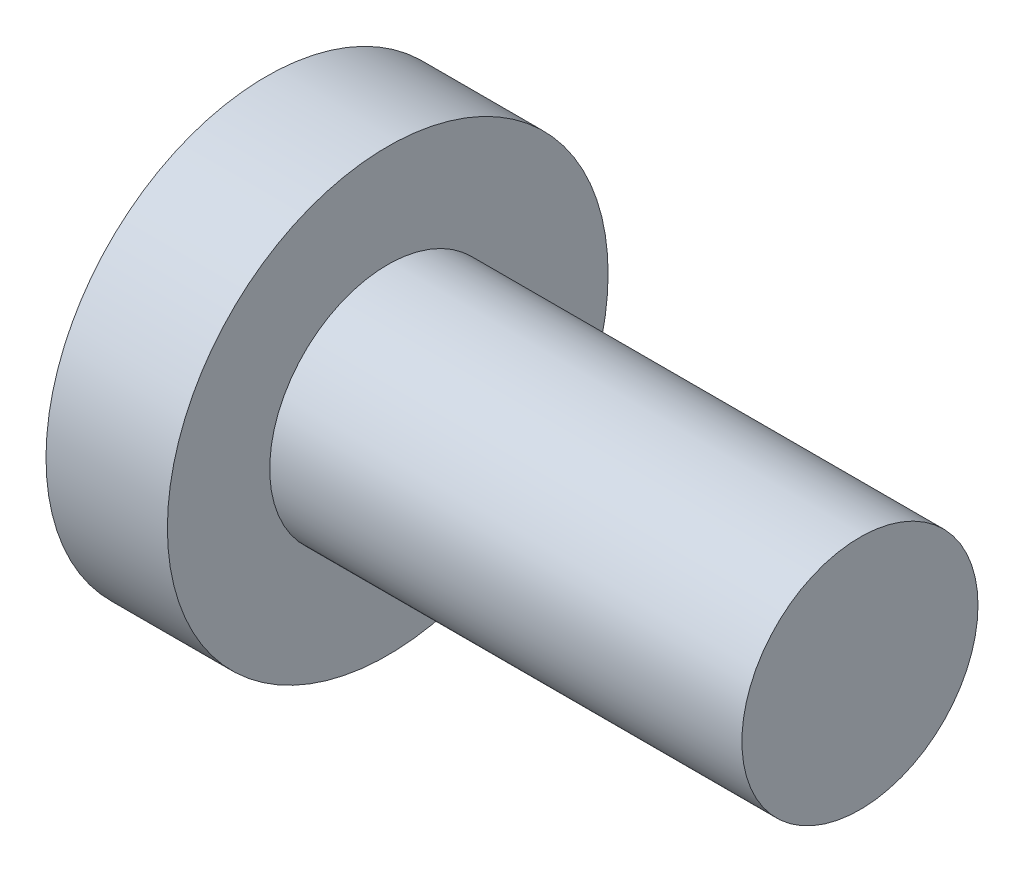
ISO-10303-21;
HEADER;
FILE_DESCRIPTION(('STEP AP214'),'2;1');
FILE_NAME('part.step','',(''),(''),'','','');
FILE_SCHEMA(('AUTOMOTIVE_DESIGN { 1 0 10303 214 1 1 1 1 }'));
ENDSEC;
DATA;
#1=APPLICATION_CONTEXT('core data for automotive mechanical design processes');
#2=APPLICATION_PROTOCOL_DEFINITION('international standard','automotive_design',2000,#1);
#3=PRODUCT_CONTEXT('',#1,'mechanical');
#4=PRODUCT('Part','Part','',(#3));
#5=PRODUCT_RELATED_PRODUCT_CATEGORY('part','',(#4));
#6=PRODUCT_DEFINITION_FORMATION('','',#4);
#7=PRODUCT_DEFINITION_CONTEXT('part definition',#1,'design');
#8=PRODUCT_DEFINITION('design','',#6,#7);
#9=PRODUCT_DEFINITION_SHAPE('','',#8);
#10=(LENGTH_UNIT() NAMED_UNIT(*) SI_UNIT(.MILLI.,.METRE.));
#11=(NAMED_UNIT(*) PLANE_ANGLE_UNIT() SI_UNIT($,.RADIAN.));
#12=(NAMED_UNIT(*) SI_UNIT($,.STERADIAN.) SOLID_ANGLE_UNIT());
#13=UNCERTAINTY_MEASURE_WITH_UNIT(LENGTH_MEASURE(1.E-05),#10,'distance_accuracy_value','');
#14=(GEOMETRIC_REPRESENTATION_CONTEXT(3) GLOBAL_UNCERTAINTY_ASSIGNED_CONTEXT((#13)) GLOBAL_UNIT_ASSIGNED_CONTEXT((#10,
#11,#12)) REPRESENTATION_CONTEXT('',''));
#15=CARTESIAN_POINT('',(0.,0.,0.));
#16=DIRECTION('',(0.,0.,1.));
#17=DIRECTION('',(1.,0.,0.));
#18=AXIS2_PLACEMENT_3D('',#15,#16,#17);
#19=CARTESIAN_POINT('',(5.,0.,0.));
#20=DIRECTION('',(1.,0.,0.));
#21=DIRECTION('',(0.,1.,0.));
#22=AXIS2_PLACEMENT_3D('',#19,#20,#21);
#23=SPHERICAL_SURFACE('',#22,5.);
#24=CARTESIAN_POINT('',(0.857536964558405,0.,0.));
#25=DIRECTION('',(1.,0.,0.));
#26=DIRECTION('',(0.,0.,-1.));
#27=AXIS2_PLACEMENT_3D('',#24,#25,#26);
#28=CIRCLE('',#27,2.8);
#29=CARTESIAN_POINT('',(0.857536964558405,0.,-2.8));
#30=VERTEX_POINT('',#29);
#31=EDGE_CURVE('E207',#30,#30,#28,.T.);
#32=ORIENTED_EDGE('',*,*,#31,.F.);
#33=EDGE_LOOP('',(#32));
#34=FACE_BOUND('',#33,.T.);
#35=CARTESIAN_POINT('',(5.,-0.3,0.));
#36=DIRECTION('',(0.,1.,0.));
#37=DIRECTION('',(0.,0.,1.));
#38=AXIS2_PLACEMENT_3D('',#35,#36,#37);
#39=CIRCLE('',#38,4.99099188538711);
#40=CARTESIAN_POINT('',(0.204192141108151,-0.3,1.3821096123648));
#41=VERTEX_POINT('',#40);
#42=CARTESIAN_POINT('',(0.0452043432650024,-0.3,0.6));
#43=VERTEX_POINT('',#42);
#44=EDGE_CURVE('E141',#41,#43,#39,.F.);
#45=ORIENTED_EDGE('',*,*,#44,.T.);
#46=CARTESIAN_POINT('',(0.0452043432650024,-0.3,0.6));
#47=CARTESIAN_POINT('',(0.0431803765733258,-0.299985307216759,0.58330066442328));
#48=CARTESIAN_POINT('',(0.0413275176268076,-0.301393621844251,0.566581310147069));
#49=CARTESIAN_POINT('',(0.0380100157488106,-0.306971694528783,0.533576799844294));
#50=CARTESIAN_POINT('',(0.0365452230698608,-0.311140385229224,0.517291478520808));
#51=CARTESIAN_POINT('',(0.0340472247062486,-0.322159146630374,0.48560301538607));
#52=CARTESIAN_POINT('',(0.0330143639783939,-0.329011352060552,0.470200587124305));
#53=CARTESIAN_POINT('',(0.0314127307694625,-0.345205676257373,0.440745323067069));
#54=CARTESIAN_POINT('',(0.0308438058607194,-0.354546975884403,0.426692045343612));
#55=CARTESIAN_POINT('',(0.0301895329231602,-0.375375503630217,0.400444519821415));
#56=CARTESIAN_POINT('',(0.0301004392402796,-0.386845384782284,0.38823659768892));
#57=CARTESIAN_POINT('',(0.0303984595749412,-0.411653153039893,0.365897305977699));
#58=CARTESIAN_POINT('',(0.0307856444365278,-0.424991317781719,0.355766245583268));
#59=CARTESIAN_POINT('',(0.0320223810339674,-0.453099677373167,0.337899284835797));
#60=CARTESIAN_POINT('',(0.0328703456862305,-0.467864814543113,0.33015530522925));
#61=CARTESIAN_POINT('',(0.0350026994062981,-0.498444042646254,0.317225069756469));
#62=CARTESIAN_POINT('',(0.0362869304045912,-0.514257751989369,0.312037889168157));
#63=CARTESIAN_POINT('',(0.0388210734003055,-0.541786224745503,0.305467740201196));
#64=CARTESIAN_POINT('',(0.0399723661586706,-0.553355690495333,0.303417160437875));
#65=CARTESIAN_POINT('',(0.0424563450668784,-0.576618891467464,0.300683149774227));
#66=CARTESIAN_POINT('',(0.0437887689490347,-0.588312424882147,0.299997764205199));
#67=CARTESIAN_POINT('',(0.0452043432650015,-0.6,0.3));
#68=B_SPLINE_CURVE_WITH_KNOTS('',3,(#46,#47,#48,#49,#50,#51,#52,#53,#54,#55,#56,#57,#58,#59,#60,
#61,#62,#63,#64,#65,#66,#67),.UNSPECIFIED.,.F.,.F.,(4,2,2,2,2,2,2,2,2,2,4),(0.,
0.0504040124836527,0.100788546583664,0.151213243139993,0.201621365810884,0.251635416538133,
0.3016569075042,0.351507189411116,0.401339428623963,0.43668054551031,0.47197102493103),.UNSPECIFIED.);
#69=CARTESIAN_POINT('',(0.0452043432650024,-0.6,0.3));
#70=VERTEX_POINT('',#69);
#71=EDGE_CURVE('E126',#43,#70,#68,.T.);
#72=ORIENTED_EDGE('',*,*,#71,.T.);
#73=CARTESIAN_POINT('',(5.,0.,0.3));
#74=DIRECTION('',(0.,0.,-1.));
#75=DIRECTION('',(0.,1.,0.));
#76=AXIS2_PLACEMENT_3D('',#73,#74,#75);
#77=CIRCLE('',#76,4.99099188538711);
#78=CARTESIAN_POINT('',(0.204192141108151,-1.3821096123648,0.3));
#79=VERTEX_POINT('',#78);
#80=EDGE_CURVE('E150',#70,#79,#77,.F.);
#81=ORIENTED_EDGE('',*,*,#80,.T.);
#82=CARTESIAN_POINT('',(4.39951905283833,1.0400635094611,0.));
#83=DIRECTION('',(-0.5,0.866025403784438,0.));
#84=DIRECTION('',(-0.866025403784438,-0.5,0.));
#85=AXIS2_PLACEMENT_3D('',#82,#83,#84);
#86=CIRCLE('',#85,4.8536265336739);
#87=CARTESIAN_POINT('',(0.204192141108151,-1.3821096123648,-0.3));
#88=VERTEX_POINT('',#87);
#89=EDGE_CURVE('E153',#79,#88,#86,.F.);
#90=ORIENTED_EDGE('',*,*,#89,.T.);
#91=CARTESIAN_POINT('',(5.,0.,-0.3));
#92=DIRECTION('',(0.,0.,1.));
#93=DIRECTION('',(1.,0.,0.));
#94=AXIS2_PLACEMENT_3D('',#91,#92,#93);
#95=CIRCLE('',#94,4.99099188538711);
#96=CARTESIAN_POINT('',(0.0452043432650024,-0.6,-0.3));
#97=VERTEX_POINT('',#96);
#98=EDGE_CURVE('E160',#88,#97,#95,.F.);
#99=ORIENTED_EDGE('',*,*,#98,.T.);
#100=CARTESIAN_POINT('',(0.0452043432650024,-0.6,-0.3));
#101=CARTESIAN_POINT('',(0.0431803765733257,-0.58330066442328,-0.299985307216759));
#102=CARTESIAN_POINT('',(0.0413275176268075,-0.56658131014707,-0.30139362184425));
#103=CARTESIAN_POINT('',(0.0380100157488106,-0.533576799844295,-0.306971694528783));
#104=CARTESIAN_POINT('',(0.0365452230698608,-0.517291478520809,-0.311140385229224));
#105=CARTESIAN_POINT('',(0.0340472247062486,-0.485603015386071,-0.322159146630374));
#106=CARTESIAN_POINT('',(0.0330143639783939,-0.470200587124306,-0.329011352060552));
#107=CARTESIAN_POINT('',(0.0314127307694625,-0.440745323067069,-0.345205676257373));
#108=CARTESIAN_POINT('',(0.0308438058607194,-0.426692045343612,-0.354546975884403));
#109=CARTESIAN_POINT('',(0.0301895329231602,-0.400444519821415,-0.375375503630217));
#110=CARTESIAN_POINT('',(0.0301004392402796,-0.38823659768892,-0.386845384782284));
#111=CARTESIAN_POINT('',(0.0303984595749412,-0.365897305977699,-0.411653153039893));
#112=CARTESIAN_POINT('',(0.0307856444365278,-0.355766245583269,-0.424991317781719));
#113=CARTESIAN_POINT('',(0.0320223810339674,-0.337899284835798,-0.453099677373167));
#114=CARTESIAN_POINT('',(0.0328703456862304,-0.330155305229251,-0.467864814543114));
#115=CARTESIAN_POINT('',(0.035002699406298,-0.317225069756469,-0.498444042646254));
#116=CARTESIAN_POINT('',(0.0362869304045912,-0.312037889168157,-0.514257751989369));
#117=CARTESIAN_POINT('',(0.0388210734003055,-0.305467740201196,-0.541786224745503));
#118=CARTESIAN_POINT('',(0.0399723661586706,-0.303417160437875,-0.553355690495333));
#119=CARTESIAN_POINT('',(0.0424563450668784,-0.300683149774227,-0.576618891467464));
#120=CARTESIAN_POINT('',(0.0437887689490347,-0.299997764205199,-0.588312424882147));
#121=CARTESIAN_POINT('',(0.0452043432650014,-0.3,-0.6));
#122=B_SPLINE_CURVE_WITH_KNOTS('',3,(#100,#101,#102,#103,#104,#105,#106,#107,#108,#109,#110,
#111,#112,#113,#114,#115,#116,#117,#118,#119,#120,#121),.UNSPECIFIED.,.F.,.F.,(4,2,2,2,2,2,2,2,
2,2,4),(0.,0.0504040124836521,0.100788546583663,0.151213243139993,0.201621365810884,
0.251635416538133,0.3016569075042,0.351507189411116,0.401339428623963,0.436680545510309,
0.471971024931029),.UNSPECIFIED.);
#123=CARTESIAN_POINT('',(0.0452043432650024,-0.3,-0.6));
#124=VERTEX_POINT('',#123);
#125=EDGE_CURVE('E137',#97,#124,#122,.T.);
#126=ORIENTED_EDGE('',*,*,#125,.T.);
#127=CARTESIAN_POINT('',(5.,-0.3,0.));
#128=DIRECTION('',(0.,1.,0.));
#129=DIRECTION('',(0.,0.,1.));
#130=AXIS2_PLACEMENT_3D('',#127,#128,#129);
#131=CIRCLE('',#130,4.99099188538711);
#132=CARTESIAN_POINT('',(0.204192141108152,-0.3,-1.3821096123648));
#133=VERTEX_POINT('',#132);
#134=EDGE_CURVE('E158',#124,#133,#131,.F.);
#135=ORIENTED_EDGE('',*,*,#134,.T.);
#136=CARTESIAN_POINT('',(4.39951905283833,0.,1.0400635094611));
#137=DIRECTION('',(-0.5,0.,0.866025403784438));
#138=DIRECTION('',(0.866025403784438,0.,0.5));
#139=AXIS2_PLACEMENT_3D('',#136,#137,#138);
#140=CIRCLE('',#139,4.8536265336739);
#141=CARTESIAN_POINT('',(0.204192141108152,0.3,-1.3821096123648));
#142=VERTEX_POINT('',#141);
#143=EDGE_CURVE('E161',#133,#142,#140,.F.);
#144=ORIENTED_EDGE('',*,*,#143,.T.);
#145=CARTESIAN_POINT('',(5.,0.3,0.));
#146=DIRECTION('',(0.,-1.,0.));
#147=DIRECTION('',(0.,0.,-1.));
#148=AXIS2_PLACEMENT_3D('',#145,#146,#147);
#149=CIRCLE('',#148,4.99099188538711);
#150=CARTESIAN_POINT('',(0.0452043432650024,0.3,-0.6));
#151=VERTEX_POINT('',#150);
#152=EDGE_CURVE('E162',#142,#151,#149,.F.);
#153=ORIENTED_EDGE('',*,*,#152,.T.);
#154=CARTESIAN_POINT('',(0.0452043432650024,0.3,-0.6));
#155=CARTESIAN_POINT('',(0.0431803765733258,0.299985307216759,-0.58330066442328));
#156=CARTESIAN_POINT('',(0.0413275176268076,0.301393621844251,-0.56658131014707));
#157=CARTESIAN_POINT('',(0.0380100157488106,0.306971694528782,-0.533576799844295));
#158=CARTESIAN_POINT('',(0.0365452230698608,0.311140385229223,-0.517291478520809));
#159=CARTESIAN_POINT('',(0.0340472247062486,0.322159146630374,-0.485603015386071));
#160=CARTESIAN_POINT('',(0.033014363978394,0.329011352060551,-0.470200587124306));
#161=CARTESIAN_POINT('',(0.0314127307694625,0.345205676257373,-0.44074532306707));
#162=CARTESIAN_POINT('',(0.0308438058607194,0.354546975884402,-0.426692045343612));
#163=CARTESIAN_POINT('',(0.0301895329231602,0.375375503630217,-0.400444519821416));
#164=CARTESIAN_POINT('',(0.0301004392402796,0.386845384782283,-0.388236597688921));
#165=CARTESIAN_POINT('',(0.0303984595749411,0.411653153039892,-0.3658973059777));
#166=CARTESIAN_POINT('',(0.0307856444365276,0.424991317781719,-0.355766245583269));
#167=CARTESIAN_POINT('',(0.0320223810339676,0.453099677373167,-0.337899284835798));
#168=CARTESIAN_POINT('',(0.0328703456862313,0.467864814543113,-0.330155305229251));
#169=CARTESIAN_POINT('',(0.0350026994062988,0.498444042646254,-0.317225069756469));
#170=CARTESIAN_POINT('',(0.0362869304045914,0.514257751989368,-0.312037889168158));
#171=CARTESIAN_POINT('',(0.0388210734003053,0.541786224745503,-0.305467740201196));
#172=CARTESIAN_POINT('',(0.0399723661586704,0.553355690495333,-0.303417160437876));
#173=CARTESIAN_POINT('',(0.0424563450668784,0.576618891467464,-0.300683149774227));
#174=CARTESIAN_POINT('',(0.0437887689490348,0.588312424882147,-0.299997764205199));
#175=CARTESIAN_POINT('',(0.0452043432650014,0.6,-0.3));
#176=B_SPLINE_CURVE_WITH_KNOTS('',3,(#154,#155,#156,#157,#158,#159,#160,#161,#162,#163,#164,
#165,#166,#167,#168,#169,#170,#171,#172,#173,#174,#175),.UNSPECIFIED.,.F.,.F.,(4,2,2,2,2,2,2,2,
2,2,4),(0.,0.0504040124836521,0.100788546583663,0.151213243139993,0.201621365810883,
0.251635416538133,0.3016569075042,0.351507189411115,0.401339428623963,0.436680545510309,
0.471971024931029),.UNSPECIFIED.);
#177=CARTESIAN_POINT('',(0.0452043432650024,0.6,-0.3));
#178=VERTEX_POINT('',#177);
#179=EDGE_CURVE('E144',#151,#178,#176,.T.);
#180=ORIENTED_EDGE('',*,*,#179,.T.);
#181=CARTESIAN_POINT('',(5.,0.,-0.3));
#182=DIRECTION('',(0.,0.,1.));
#183=DIRECTION('',(1.,0.,0.));
#184=AXIS2_PLACEMENT_3D('',#181,#182,#183);
#185=CIRCLE('',#184,4.99099188538711);
#186=CARTESIAN_POINT('',(0.204192141108151,1.3821096123648,-0.3));
#187=VERTEX_POINT('',#186);
#188=EDGE_CURVE('E165',#178,#187,#185,.F.);
#189=ORIENTED_EDGE('',*,*,#188,.T.);
#190=CARTESIAN_POINT('',(4.39951905283833,-1.0400635094611,0.));
#191=DIRECTION('',(-0.5,-0.866025403784438,0.));
#192=DIRECTION('',(0.866025403784438,-0.5,0.));
#193=AXIS2_PLACEMENT_3D('',#190,#191,#192);
#194=CIRCLE('',#193,4.8536265336739);
#195=CARTESIAN_POINT('',(0.204192141108151,1.3821096123648,0.3));
#196=VERTEX_POINT('',#195);
#197=EDGE_CURVE('E191',#187,#196,#194,.F.);
#198=ORIENTED_EDGE('',*,*,#197,.T.);
#199=CARTESIAN_POINT('',(5.,0.,0.3));
#200=DIRECTION('',(0.,0.,-1.));
#201=DIRECTION('',(0.,1.,0.));
#202=AXIS2_PLACEMENT_3D('',#199,#200,#201);
#203=CIRCLE('',#202,4.99099188538711);
#204=CARTESIAN_POINT('',(0.0452043432650024,0.6,0.3));
#205=VERTEX_POINT('',#204);
#206=EDGE_CURVE('E194',#196,#205,#203,.F.);
#207=ORIENTED_EDGE('',*,*,#206,.T.);
#208=CARTESIAN_POINT('',(0.0452043432650024,0.6,0.3));
#209=CARTESIAN_POINT('',(0.0431803765733258,0.58330066442328,0.299985307216759));
#210=CARTESIAN_POINT('',(0.0413275176268076,0.56658131014707,0.301393621844251));
#211=CARTESIAN_POINT('',(0.0380100157488106,0.533576799844295,0.306971694528782));
#212=CARTESIAN_POINT('',(0.0365452230698608,0.517291478520809,0.311140385229223));
#213=CARTESIAN_POINT('',(0.0340472247062486,0.485603015386071,0.322159146630374));
#214=CARTESIAN_POINT('',(0.033014363978394,0.470200587124306,0.329011352060551));
#215=CARTESIAN_POINT('',(0.0314127307694625,0.44074532306707,0.345205676257373));
#216=CARTESIAN_POINT('',(0.0308438058607194,0.426692045343612,0.354546975884402));
#217=CARTESIAN_POINT('',(0.0301895329231602,0.400444519821415,0.375375503630217));
#218=CARTESIAN_POINT('',(0.0301004392402796,0.38823659768892,0.386845384782283));
#219=CARTESIAN_POINT('',(0.0303984595749412,0.3658973059777,0.411653153039893));
#220=CARTESIAN_POINT('',(0.0307856444365278,0.355766245583269,0.424991317781719));
#221=CARTESIAN_POINT('',(0.0320223810339674,0.337899284835798,0.453099677373167));
#222=CARTESIAN_POINT('',(0.0328703456862304,0.330155305229251,0.467864814543113));
#223=CARTESIAN_POINT('',(0.035002699406298,0.317225069756469,0.498444042646254));
#224=CARTESIAN_POINT('',(0.0362869304045912,0.312037889168157,0.514257751989369));
#225=CARTESIAN_POINT('',(0.0388210734003055,0.305467740201196,0.541786224745503));
#226=CARTESIAN_POINT('',(0.0399723661586705,0.303417160437875,0.553355690495333));
#227=CARTESIAN_POINT('',(0.0424563450668783,0.300683149774227,0.576618891467464));
#228=CARTESIAN_POINT('',(0.0437887689490347,0.299997764205199,0.588312424882147));
#229=CARTESIAN_POINT('',(0.0452043432650014,0.3,0.6));
#230=B_SPLINE_CURVE_WITH_KNOTS('',3,(#208,#209,#210,#211,#212,#213,#214,#215,#216,#217,#218,
#219,#220,#221,#222,#223,#224,#225,#226,#227,#228,#229),.UNSPECIFIED.,.F.,.F.,(4,2,2,2,2,2,2,2,
2,2,4),(0.,0.0504040124836521,0.100788546583663,0.151213243139993,0.201621365810884,
0.251635416538133,0.3016569075042,0.351507189411116,0.401339428623963,0.43668054551031,
0.47197102493103),.UNSPECIFIED.);
#231=CARTESIAN_POINT('',(0.0452043432650024,0.3,0.6));
#232=VERTEX_POINT('',#231);
#233=EDGE_CURVE('E264',#205,#232,#230,.T.);
#234=ORIENTED_EDGE('',*,*,#233,.T.);
#235=CARTESIAN_POINT('',(5.,0.3,0.));
#236=DIRECTION('',(0.,-1.,0.));
#237=DIRECTION('',(0.,0.,-1.));
#238=AXIS2_PLACEMENT_3D('',#235,#236,#237);
#239=CIRCLE('',#238,4.99099188538711);
#240=CARTESIAN_POINT('',(0.204192141108151,0.3,1.3821096123648));
#241=VERTEX_POINT('',#240);
#242=EDGE_CURVE('E145',#232,#241,#239,.F.);
#243=ORIENTED_EDGE('',*,*,#242,.T.);
#244=CARTESIAN_POINT('',(4.39951905283833,0.,-1.0400635094611));
#245=DIRECTION('',(-0.5,0.,-0.866025403784438));
#246=DIRECTION('',(-0.866025403784438,0.,0.5));
#247=AXIS2_PLACEMENT_3D('',#244,#245,#246);
#248=CIRCLE('',#247,4.8536265336739);
#249=EDGE_CURVE('E149',#241,#41,#248,.F.);
#250=ORIENTED_EDGE('',*,*,#249,.T.);
#251=EDGE_LOOP('',(#45,#72,#81,#90,#99,#126,#135,#144,#153,#180,#189,#198,#207,#234,#243,#250));
#252=FACE_BOUND('',#251,.T.);
#253=ADVANCED_FACE('F16',(#34,#252),#23,.T.);
#254=CARTESIAN_POINT('',(8.4,1.5,0.));
#255=DIRECTION('',(1.,0.,0.));
#256=DIRECTION('',(0.,0.,-1.));
#257=AXIS2_PLACEMENT_3D('',#254,#255,#256);
#258=PLANE('',#257);
#259=CARTESIAN_POINT('',(8.4,0.,0.));
#260=DIRECTION('',(1.,0.,0.));
#261=DIRECTION('',(0.,0.,-1.));
#262=AXIS2_PLACEMENT_3D('',#259,#260,#261);
#263=CIRCLE('',#262,1.5);
#264=CARTESIAN_POINT('',(8.4,0.,-1.5));
#265=VERTEX_POINT('',#264);
#266=EDGE_CURVE('E246',#265,#265,#263,.T.);
#267=ORIENTED_EDGE('',*,*,#266,.T.);
#268=EDGE_LOOP('',(#267));
#269=FACE_BOUND('',#268,.T.);
#270=ADVANCED_FACE('F304',(#269),#258,.T.);
#271=CARTESIAN_POINT('',(4.51581291088132,0.,0.));
#272=DIRECTION('',(1.,0.,0.));
#273=DIRECTION('',(0.,0.,-1.));
#274=AXIS2_PLACEMENT_3D('',#271,#272,#273);
#275=CYLINDRICAL_SURFACE('',#274,1.5);
#276=CARTESIAN_POINT('',(2.4,0.,0.));
#277=DIRECTION('',(1.,0.,0.));
#278=DIRECTION('',(0.,0.,-1.));
#279=AXIS2_PLACEMENT_3D('',#276,#277,#278);
#280=CIRCLE('',#279,1.5);
#281=CARTESIAN_POINT('',(2.4,0.,-1.5));
#282=VERTEX_POINT('',#281);
#283=EDGE_CURVE('E248',#282,#282,#280,.T.);
#284=ORIENTED_EDGE('',*,*,#283,.T.);
#285=EDGE_LOOP('',(#284));
#286=FACE_BOUND('',#285,.T.);
#287=ORIENTED_EDGE('',*,*,#266,.F.);
#288=EDGE_LOOP('',(#287));
#289=FACE_BOUND('',#288,.T.);
#290=ADVANCED_FACE('F310',(#286,#289),#275,.T.);
#291=CARTESIAN_POINT('',(2.4,1.8,0.));
#292=DIRECTION('',(1.,0.,0.));
#293=DIRECTION('',(0.,0.,-1.));
#294=AXIS2_PLACEMENT_3D('',#291,#292,#293);
#295=PLANE('',#294);
#296=CARTESIAN_POINT('',(2.4,0.,0.));
#297=DIRECTION('',(1.,0.,0.));
#298=DIRECTION('',(0.,0.,-1.));
#299=AXIS2_PLACEMENT_3D('',#296,#297,#298);
#300=CIRCLE('',#299,2.8);
#301=CARTESIAN_POINT('',(2.4,0.,-2.8));
#302=VERTEX_POINT('',#301);
#303=EDGE_CURVE('E253',#302,#302,#300,.T.);
#304=ORIENTED_EDGE('',*,*,#303,.T.);
#305=EDGE_LOOP('',(#304));
#306=FACE_BOUND('',#305,.T.);
#307=ORIENTED_EDGE('',*,*,#283,.F.);
#308=EDGE_LOOP('',(#307));
#309=FACE_BOUND('',#308,.T.);
#310=ADVANCED_FACE('F319',(#306,#309),#295,.T.);
#311=CARTESIAN_POINT('',(4.51581291088132,0.,0.));
#312=DIRECTION('',(1.,0.,0.));
#313=DIRECTION('',(0.,0.,-1.));
#314=AXIS2_PLACEMENT_3D('',#311,#312,#313);
#315=CYLINDRICAL_SURFACE('',#314,2.8);
#316=ORIENTED_EDGE('',*,*,#31,.T.);
#317=EDGE_LOOP('',(#316));
#318=FACE_BOUND('',#317,.T.);
#319=ORIENTED_EDGE('',*,*,#303,.F.);
#320=EDGE_LOOP('',(#319));
#321=FACE_BOUND('',#320,.T.);
#322=ADVANCED_FACE('F300',(#318,#321),#315,.T.);
#323=CARTESIAN_POINT('',(1.68,0.3,0.3));
#324=DIRECTION('',(0.,-1.,0.));
#325=DIRECTION('',(0.,0.,-1.));
#326=AXIS2_PLACEMENT_3D('',#323,#324,#325);
#327=PLANE('',#326);
#328=ORIENTED_EDGE('',*,*,#242,.F.);
#329=DIRECTION('',(-1.,0.,0.));
#330=VECTOR('',#329,1.);
#331=CARTESIAN_POINT('',(1.68,0.3,0.6));
#332=LINE('',#331,#330);
#333=CARTESIAN_POINT('',(1.55884572681199,0.3,0.6));
#334=VERTEX_POINT('',#333);
#335=EDGE_CURVE('E355',#232,#334,#332,.F.);
#336=ORIENTED_EDGE('',*,*,#335,.T.);
#337=DIRECTION('',(-0.866025403784438,0.,0.5));
#338=VECTOR('',#337,1.);
#339=CARTESIAN_POINT('',(0.,0.3,1.5));
#340=LINE('',#339,#338);
#341=EDGE_CURVE('E205',#334,#241,#340,.T.);
#342=ORIENTED_EDGE('',*,*,#341,.T.);
#343=EDGE_LOOP('',(#328,#336,#342));
#344=FACE_BOUND('',#343,.T.);
#345=ADVANCED_FACE('F291',(#344),#327,.T.);
#346=CARTESIAN_POINT('',(0.,0.,1.5));
#347=DIRECTION('',(-0.5,0.,-0.866025403784438));
#348=DIRECTION('',(-0.866025403784438,0.,0.5));
#349=AXIS2_PLACEMENT_3D('',#346,#347,#348);
#350=PLANE('',#349);
#351=ORIENTED_EDGE('',*,*,#341,.F.);
#352=CARTESIAN_POINT('',(1.55884572681199,0.6,0.6));
#353=DIRECTION('',(-0.5,0.,-0.866025403784438));
#354=DIRECTION('',(-0.866025403784438,0.,0.5));
#355=AXIS2_PLACEMENT_3D('',#352,#353,#354);
#356=ELLIPSE('',#355,0.6,0.3);
#357=CARTESIAN_POINT('',(1.68,0.308268592658542,0.530051547761426));
#358=VERTEX_POINT('',#357);
#359=EDGE_CURVE('E212',#334,#358,#356,.F.);
#360=ORIENTED_EDGE('',*,*,#359,.T.);
#361=DIRECTION('',(0.,-1.,0.));
#362=VECTOR('',#361,1.);
#363=CARTESIAN_POINT('',(1.68,0.,0.530051547761426));
#364=LINE('',#363,#362);
#365=CARTESIAN_POINT('',(1.68,-0.308268592658542,0.530051547761426));
#366=VERTEX_POINT('',#365);
#367=EDGE_CURVE('E178',#358,#366,#364,.T.);
#368=ORIENTED_EDGE('',*,*,#367,.T.);
#369=CARTESIAN_POINT('',(1.55884572681199,-0.6,0.6));
#370=DIRECTION('',(-0.5,0.,-0.866025403784438));
#371=DIRECTION('',(-0.866025403784438,0.,0.5));
#372=AXIS2_PLACEMENT_3D('',#369,#370,#371);
#373=ELLIPSE('',#372,0.6,0.3);
#374=CARTESIAN_POINT('',(1.55884572681199,-0.3,0.6));
#375=VERTEX_POINT('',#374);
#376=EDGE_CURVE('E204',#375,#366,#373,.T.);
#377=ORIENTED_EDGE('',*,*,#376,.F.);
#378=DIRECTION('',(-0.866025403784438,0.,0.5));
#379=VECTOR('',#378,1.);
#380=CARTESIAN_POINT('',(1.77961524227066,-0.3,0.472538660821069));
#381=LINE('',#380,#379);
#382=EDGE_CURVE('E143',#375,#41,#381,.T.);
#383=ORIENTED_EDGE('',*,*,#382,.T.);
#384=ORIENTED_EDGE('',*,*,#249,.F.);
#385=EDGE_LOOP('',(#351,#360,#368,#377,#383,#384));
#386=FACE_BOUND('',#385,.T.);
#387=ADVANCED_FACE('F289',(#386),#350,.T.);
#388=CARTESIAN_POINT('',(1.68,-0.3,0.3));
#389=DIRECTION('',(0.,1.,0.));
#390=DIRECTION('',(0.,0.,1.));
#391=AXIS2_PLACEMENT_3D('',#388,#389,#390);
#392=PLANE('',#391);
#393=ORIENTED_EDGE('',*,*,#382,.F.);
#394=DIRECTION('',(-1.,0.,0.));
#395=VECTOR('',#394,1.);
#396=CARTESIAN_POINT('',(1.68,-0.3,0.6));
#397=LINE('',#396,#395);
#398=EDGE_CURVE('E130',#375,#43,#397,.T.);
#399=ORIENTED_EDGE('',*,*,#398,.T.);
#400=ORIENTED_EDGE('',*,*,#44,.F.);
#401=EDGE_LOOP('',(#393,#399,#400));
#402=FACE_BOUND('',#401,.T.);
#403=ADVANCED_FACE('F140',(#402),#392,.T.);
#404=CARTESIAN_POINT('',(1.68,-0.3,0.3));
#405=DIRECTION('',(0.,0.,-1.));
#406=DIRECTION('',(0.,1.,0.));
#407=AXIS2_PLACEMENT_3D('',#404,#405,#406);
#408=PLANE('',#407);
#409=ORIENTED_EDGE('',*,*,#80,.F.);
#410=DIRECTION('',(-1.,0.,0.));
#411=VECTOR('',#410,1.);
#412=CARTESIAN_POINT('',(1.68,-0.6,0.3));
#413=LINE('',#412,#411);
#414=CARTESIAN_POINT('',(1.55884572681199,-0.6,0.3));
#415=VERTEX_POINT('',#414);
#416=EDGE_CURVE('E133',#70,#415,#413,.F.);
#417=ORIENTED_EDGE('',*,*,#416,.T.);
#418=DIRECTION('',(-0.866025403784438,-0.5,0.));
#419=VECTOR('',#418,1.);
#420=CARTESIAN_POINT('',(0.,-1.5,0.3));
#421=LINE('',#420,#419);
#422=EDGE_CURVE('E166',#415,#79,#421,.T.);
#423=ORIENTED_EDGE('',*,*,#422,.T.);
#424=EDGE_LOOP('',(#409,#417,#423));
#425=FACE_BOUND('',#424,.T.);
#426=ADVANCED_FACE('F284',(#425),#408,.T.);
#427=CARTESIAN_POINT('',(0.,-1.5,0.));
#428=DIRECTION('',(-0.5,0.866025403784438,0.));
#429=DIRECTION('',(-0.866025403784438,-0.5,0.));
#430=AXIS2_PLACEMENT_3D('',#427,#428,#429);
#431=PLANE('',#430);
#432=ORIENTED_EDGE('',*,*,#422,.F.);
#433=CARTESIAN_POINT('',(1.55884572681199,-0.6,0.6));
#434=DIRECTION('',(-0.5,0.866025403784438,0.));
#435=DIRECTION('',(-0.866025403784438,-0.5,0.));
#436=AXIS2_PLACEMENT_3D('',#433,#434,#435);
#437=ELLIPSE('',#436,0.6,0.3);
#438=CARTESIAN_POINT('',(1.68,-0.530051547761426,0.308268592658541));
#439=VERTEX_POINT('',#438);
#440=EDGE_CURVE('E181',#415,#439,#437,.F.);
#441=ORIENTED_EDGE('',*,*,#440,.T.);
#442=DIRECTION('',(0.,0.,-1.));
#443=VECTOR('',#442,1.);
#444=CARTESIAN_POINT('',(1.68,-0.530051547761426,0.));
#445=LINE('',#444,#443);
#446=CARTESIAN_POINT('',(1.68,-0.530051547761426,-0.308268592658542));
#447=VERTEX_POINT('',#446);
#448=EDGE_CURVE('E175',#439,#447,#445,.T.);
#449=ORIENTED_EDGE('',*,*,#448,.T.);
#450=CARTESIAN_POINT('',(1.55884572681199,-0.6,-0.6));
#451=DIRECTION('',(-0.5,0.866025403784438,0.));
#452=DIRECTION('',(-0.866025403784438,-0.5,0.));
#453=AXIS2_PLACEMENT_3D('',#450,#451,#452);
#454=ELLIPSE('',#453,0.6,0.3);
#455=CARTESIAN_POINT('',(1.55884572681199,-0.6,-0.3));
#456=VERTEX_POINT('',#455);
#457=EDGE_CURVE('E179',#456,#447,#454,.T.);
#458=ORIENTED_EDGE('',*,*,#457,.F.);
#459=DIRECTION('',(-0.866025403784438,-0.5,0.));
#460=VECTOR('',#459,1.);
#461=CARTESIAN_POINT('',(1.77961524227066,-0.472538660821069,-0.3));
#462=LINE('',#461,#460);
#463=EDGE_CURVE('E169',#456,#88,#462,.T.);
#464=ORIENTED_EDGE('',*,*,#463,.T.);
#465=ORIENTED_EDGE('',*,*,#89,.F.);
#466=EDGE_LOOP('',(#432,#441,#449,#458,#464,#465));
#467=FACE_BOUND('',#466,.T.);
#468=ADVANCED_FACE('F280',(#467),#431,.T.);
#469=CARTESIAN_POINT('',(1.68,-0.3,-0.3));
#470=DIRECTION('',(0.,0.,1.));
#471=DIRECTION('',(1.,0.,0.));
#472=AXIS2_PLACEMENT_3D('',#469,#470,#471);
#473=PLANE('',#472);
#474=ORIENTED_EDGE('',*,*,#463,.F.);
#475=DIRECTION('',(-1.,0.,0.));
#476=VECTOR('',#475,1.);
#477=CARTESIAN_POINT('',(1.68,-0.6,-0.3));
#478=LINE('',#477,#476);
#479=EDGE_CURVE('E346',#456,#97,#478,.T.);
#480=ORIENTED_EDGE('',*,*,#479,.T.);
#481=ORIENTED_EDGE('',*,*,#98,.F.);
#482=EDGE_LOOP('',(#474,#480,#481));
#483=FACE_BOUND('',#482,.T.);
#484=ADVANCED_FACE('F283',(#483),#473,.T.);
#485=CARTESIAN_POINT('',(1.68,-0.3,-0.3));
#486=DIRECTION('',(0.,1.,0.));
#487=DIRECTION('',(0.,0.,1.));
#488=AXIS2_PLACEMENT_3D('',#485,#486,#487);
#489=PLANE('',#488);
#490=ORIENTED_EDGE('',*,*,#134,.F.);
#491=DIRECTION('',(-1.,0.,0.));
#492=VECTOR('',#491,1.);
#493=CARTESIAN_POINT('',(1.68,-0.3,-0.6));
#494=LINE('',#493,#492);
#495=CARTESIAN_POINT('',(1.55884572681199,-0.3,-0.6));
#496=VERTEX_POINT('',#495);
#497=EDGE_CURVE('E349',#124,#496,#494,.F.);
#498=ORIENTED_EDGE('',*,*,#497,.T.);
#499=DIRECTION('',(-0.866025403784438,0.,-0.5));
#500=VECTOR('',#499,1.);
#501=CARTESIAN_POINT('',(0.,-0.3,-1.5));
#502=LINE('',#501,#500);
#503=EDGE_CURVE('E174',#496,#133,#502,.T.);
#504=ORIENTED_EDGE('',*,*,#503,.T.);
#505=EDGE_LOOP('',(#490,#498,#504));
#506=FACE_BOUND('',#505,.T.);
#507=ADVANCED_FACE('F288',(#506),#489,.T.);
#508=CARTESIAN_POINT('',(0.,0.,-1.5));
#509=DIRECTION('',(-0.5,0.,0.866025403784438));
#510=DIRECTION('',(0.866025403784438,0.,0.5));
#511=AXIS2_PLACEMENT_3D('',#508,#509,#510);
#512=PLANE('',#511);
#513=ORIENTED_EDGE('',*,*,#503,.F.);
#514=CARTESIAN_POINT('',(1.55884572681199,-0.6,-0.6));
#515=DIRECTION('',(-0.5,0.,0.866025403784438));
#516=DIRECTION('',(-0.866025403784438,0.,-0.5));
#517=AXIS2_PLACEMENT_3D('',#514,#515,#516);
#518=ELLIPSE('',#517,0.6,0.3);
#519=CARTESIAN_POINT('',(1.68,-0.308268592658542,-0.530051547761427));
#520=VERTEX_POINT('',#519);
#521=EDGE_CURVE('E11',#496,#520,#518,.F.);
#522=ORIENTED_EDGE('',*,*,#521,.T.);
#523=DIRECTION('',(0.,1.,0.));
#524=VECTOR('',#523,1.);
#525=CARTESIAN_POINT('',(1.68,0.,-0.530051547761427));
#526=LINE('',#525,#524);
#527=CARTESIAN_POINT('',(1.68,0.308268592658542,-0.530051547761427));
#528=VERTEX_POINT('',#527);
#529=EDGE_CURVE('E177',#520,#528,#526,.T.);
#530=ORIENTED_EDGE('',*,*,#529,.T.);
#531=CARTESIAN_POINT('',(1.55884572681199,0.6,-0.6));
#532=DIRECTION('',(-0.5,0.,0.866025403784438));
#533=DIRECTION('',(-0.866025403784438,0.,-0.5));
#534=AXIS2_PLACEMENT_3D('',#531,#532,#533);
#535=ELLIPSE('',#534,0.6,0.3);
#536=CARTESIAN_POINT('',(1.55884572681199,0.3,-0.6));
#537=VERTEX_POINT('',#536);
#538=EDGE_CURVE('E25',#537,#528,#535,.T.);
#539=ORIENTED_EDGE('',*,*,#538,.F.);
#540=DIRECTION('',(-0.866025403784438,0.,-0.5));
#541=VECTOR('',#540,1.);
#542=CARTESIAN_POINT('',(1.77961524227066,0.3,-0.47253866082107));
#543=LINE('',#542,#541);
#544=EDGE_CURVE('E189',#537,#142,#543,.T.);
#545=ORIENTED_EDGE('',*,*,#544,.T.);
#546=ORIENTED_EDGE('',*,*,#143,.F.);
#547=EDGE_LOOP('',(#513,#522,#530,#539,#545,#546));
#548=FACE_BOUND('',#547,.T.);
#549=ADVANCED_FACE('F232',(#548),#512,.T.);
#550=CARTESIAN_POINT('',(1.68,0.3,-0.3));
#551=DIRECTION('',(0.,-1.,0.));
#552=DIRECTION('',(0.,0.,-1.));
#553=AXIS2_PLACEMENT_3D('',#550,#551,#552);
#554=PLANE('',#553);
#555=ORIENTED_EDGE('',*,*,#544,.F.);
#556=DIRECTION('',(-1.,0.,0.));
#557=VECTOR('',#556,1.);
#558=CARTESIAN_POINT('',(1.68,0.3,-0.6));
#559=LINE('',#558,#557);
#560=EDGE_CURVE('E228',#537,#151,#559,.T.);
#561=ORIENTED_EDGE('',*,*,#560,.T.);
#562=ORIENTED_EDGE('',*,*,#152,.F.);
#563=EDGE_LOOP('',(#555,#561,#562));
#564=FACE_BOUND('',#563,.T.);
#565=ADVANCED_FACE('F287',(#564),#554,.T.);
#566=CARTESIAN_POINT('',(1.68,0.3,-0.3));
#567=DIRECTION('',(0.,0.,1.));
#568=DIRECTION('',(1.,0.,0.));
#569=AXIS2_PLACEMENT_3D('',#566,#567,#568);
#570=PLANE('',#569);
#571=ORIENTED_EDGE('',*,*,#188,.F.);
#572=DIRECTION('',(-1.,0.,0.));
#573=VECTOR('',#572,1.);
#574=CARTESIAN_POINT('',(1.68,0.6,-0.3));
#575=LINE('',#574,#573);
#576=CARTESIAN_POINT('',(1.55884572681199,0.6,-0.3));
#577=VERTEX_POINT('',#576);
#578=EDGE_CURVE('E359',#178,#577,#575,.F.);
#579=ORIENTED_EDGE('',*,*,#578,.T.);
#580=DIRECTION('',(-0.866025403784438,0.5,0.));
#581=VECTOR('',#580,1.);
#582=CARTESIAN_POINT('',(0.,1.5,-0.3));
#583=LINE('',#582,#581);
#584=EDGE_CURVE('E186',#577,#187,#583,.T.);
#585=ORIENTED_EDGE('',*,*,#584,.T.);
#586=EDGE_LOOP('',(#571,#579,#585));
#587=FACE_BOUND('',#586,.T.);
#588=ADVANCED_FACE('F379',(#587),#570,.T.);
#589=CARTESIAN_POINT('',(0.,1.5,0.));
#590=DIRECTION('',(-0.5,-0.866025403784438,0.));
#591=DIRECTION('',(0.866025403784438,-0.5,0.));
#592=AXIS2_PLACEMENT_3D('',#589,#590,#591);
#593=PLANE('',#592);
#594=ORIENTED_EDGE('',*,*,#584,.F.);
#595=CARTESIAN_POINT('',(1.55884572681199,0.6,-0.6));
#596=DIRECTION('',(-0.5,-0.866025403784438,0.));
#597=DIRECTION('',(-0.866025403784438,0.5,0.));
#598=AXIS2_PLACEMENT_3D('',#595,#596,#597);
#599=ELLIPSE('',#598,0.6,0.3);
#600=CARTESIAN_POINT('',(1.68,0.530051547761426,-0.308268592658542));
#601=VERTEX_POINT('',#600);
#602=EDGE_CURVE('E201',#577,#601,#599,.F.);
#603=ORIENTED_EDGE('',*,*,#602,.T.);
#604=DIRECTION('',(0.,0.,1.));
#605=VECTOR('',#604,1.);
#606=CARTESIAN_POINT('',(1.68,0.530051547761426,0.));
#607=LINE('',#606,#605);
#608=CARTESIAN_POINT('',(1.68,0.530051547761426,0.308268592658542));
#609=VERTEX_POINT('',#608);
#610=EDGE_CURVE('E197',#601,#609,#607,.T.);
#611=ORIENTED_EDGE('',*,*,#610,.T.);
#612=CARTESIAN_POINT('',(1.55884572681199,0.6,0.6));
#613=DIRECTION('',(-0.5,-0.866025403784438,0.));
#614=DIRECTION('',(-0.866025403784438,0.5,0.));
#615=AXIS2_PLACEMENT_3D('',#612,#613,#614);
#616=ELLIPSE('',#615,0.6,0.3);
#617=CARTESIAN_POINT('',(1.55884572681199,0.6,0.3));
#618=VERTEX_POINT('',#617);
#619=EDGE_CURVE('E185',#618,#609,#616,.T.);
#620=ORIENTED_EDGE('',*,*,#619,.F.);
#621=DIRECTION('',(-0.866025403784438,0.5,0.));
#622=VECTOR('',#621,1.);
#623=CARTESIAN_POINT('',(1.77961524227066,0.472538660821069,0.3));
#624=LINE('',#623,#622);
#625=EDGE_CURVE('E190',#618,#196,#624,.T.);
#626=ORIENTED_EDGE('',*,*,#625,.T.);
#627=ORIENTED_EDGE('',*,*,#197,.F.);
#628=EDGE_LOOP('',(#594,#603,#611,#620,#626,#627));
#629=FACE_BOUND('',#628,.T.);
#630=ADVANCED_FACE('F18',(#629),#593,.T.);
#631=CARTESIAN_POINT('',(1.68,0.3,0.3));
#632=DIRECTION('',(0.,0.,-1.));
#633=DIRECTION('',(0.,1.,0.));
#634=AXIS2_PLACEMENT_3D('',#631,#632,#633);
#635=PLANE('',#634);
#636=ORIENTED_EDGE('',*,*,#625,.F.);
#637=DIRECTION('',(-1.,0.,0.));
#638=VECTOR('',#637,1.);
#639=CARTESIAN_POINT('',(1.68,0.6,0.3));
#640=LINE('',#639,#638);
#641=EDGE_CURVE('E352',#618,#205,#640,.T.);
#642=ORIENTED_EDGE('',*,*,#641,.T.);
#643=ORIENTED_EDGE('',*,*,#206,.F.);
#644=EDGE_LOOP('',(#636,#642,#643));
#645=FACE_BOUND('',#644,.T.);
#646=ADVANCED_FACE('F405',(#645),#635,.T.);
#647=CARTESIAN_POINT('',(1.68,0.3,0.3));
#648=DIRECTION('',(1.,0.,0.));
#649=DIRECTION('',(0.,0.,-1.));
#650=AXIS2_PLACEMENT_3D('',#647,#648,#649);
#651=PLANE('',#650);
#652=ORIENTED_EDGE('',*,*,#367,.F.);
#653=CARTESIAN_POINT('',(1.68,0.6,0.6));
#654=DIRECTION('',(1.,0.,0.));
#655=DIRECTION('',(0.,0.,-1.));
#656=AXIS2_PLACEMENT_3D('',#653,#654,#655);
#657=CIRCLE('',#656,0.3);
#658=EDGE_CURVE('E238',#358,#609,#657,.T.);
#659=ORIENTED_EDGE('',*,*,#658,.T.);
#660=ORIENTED_EDGE('',*,*,#610,.F.);
#661=CARTESIAN_POINT('',(1.68,0.6,-0.6));
#662=DIRECTION('',(1.,0.,0.));
#663=DIRECTION('',(0.,0.,-1.));
#664=AXIS2_PLACEMENT_3D('',#661,#662,#663);
#665=CIRCLE('',#664,0.3);
#666=EDGE_CURVE('E182',#601,#528,#665,.T.);
#667=ORIENTED_EDGE('',*,*,#666,.T.);
#668=ORIENTED_EDGE('',*,*,#529,.F.);
#669=CARTESIAN_POINT('',(1.68,-0.6,-0.6));
#670=DIRECTION('',(1.,0.,0.));
#671=DIRECTION('',(0.,0.,-1.));
#672=AXIS2_PLACEMENT_3D('',#669,#670,#671);
#673=CIRCLE('',#672,0.3);
#674=EDGE_CURVE('E33',#520,#447,#673,.T.);
#675=ORIENTED_EDGE('',*,*,#674,.T.);
#676=ORIENTED_EDGE('',*,*,#448,.F.);
#677=CARTESIAN_POINT('',(1.68,-0.6,0.6));
#678=DIRECTION('',(1.,0.,0.));
#679=DIRECTION('',(0.,0.,-1.));
#680=AXIS2_PLACEMENT_3D('',#677,#678,#679);
#681=CIRCLE('',#680,0.3);
#682=EDGE_CURVE('E362',#439,#366,#681,.T.);
#683=ORIENTED_EDGE('',*,*,#682,.T.);
#684=EDGE_LOOP('',(#652,#659,#660,#667,#668,#675,#676,#683));
#685=FACE_BOUND('',#684,.T.);
#686=ADVANCED_FACE('F236',(#685),#651,.F.);
#687=CARTESIAN_POINT('',(1.68,-0.6,0.6));
#688=DIRECTION('',(-1.,0.,0.));
#689=DIRECTION('',(0.,0.,1.));
#690=AXIS2_PLACEMENT_3D('',#687,#688,#689);
#691=CYLINDRICAL_SURFACE('',#690,0.3);
#692=ORIENTED_EDGE('',*,*,#682,.F.);
#693=ORIENTED_EDGE('',*,*,#440,.F.);
#694=ORIENTED_EDGE('',*,*,#416,.F.);
#695=ORIENTED_EDGE('',*,*,#71,.F.);
#696=ORIENTED_EDGE('',*,*,#398,.F.);
#697=ORIENTED_EDGE('',*,*,#376,.T.);
#698=EDGE_LOOP('',(#692,#693,#694,#695,#696,#697));
#699=FACE_BOUND('',#698,.T.);
#700=ADVANCED_FACE('F128',(#699),#691,.T.);
#701=CARTESIAN_POINT('',(1.68,-0.6,-0.6));
#702=DIRECTION('',(-1.,0.,0.));
#703=DIRECTION('',(0.,0.,1.));
#704=AXIS2_PLACEMENT_3D('',#701,#702,#703);
#705=CYLINDRICAL_SURFACE('',#704,0.3);
#706=ORIENTED_EDGE('',*,*,#674,.F.);
#707=ORIENTED_EDGE('',*,*,#521,.F.);
#708=ORIENTED_EDGE('',*,*,#497,.F.);
#709=ORIENTED_EDGE('',*,*,#125,.F.);
#710=ORIENTED_EDGE('',*,*,#479,.F.);
#711=ORIENTED_EDGE('',*,*,#457,.T.);
#712=EDGE_LOOP('',(#706,#707,#708,#709,#710,#711));
#713=FACE_BOUND('',#712,.T.);
#714=ADVANCED_FACE('F334',(#713),#705,.T.);
#715=CARTESIAN_POINT('',(1.68,0.6,0.6));
#716=DIRECTION('',(-1.,0.,0.));
#717=DIRECTION('',(0.,0.,1.));
#718=AXIS2_PLACEMENT_3D('',#715,#716,#717);
#719=CYLINDRICAL_SURFACE('',#718,0.3);
#720=ORIENTED_EDGE('',*,*,#658,.F.);
#721=ORIENTED_EDGE('',*,*,#359,.F.);
#722=ORIENTED_EDGE('',*,*,#335,.F.);
#723=ORIENTED_EDGE('',*,*,#233,.F.);
#724=ORIENTED_EDGE('',*,*,#641,.F.);
#725=ORIENTED_EDGE('',*,*,#619,.T.);
#726=EDGE_LOOP('',(#720,#721,#722,#723,#724,#725));
#727=FACE_BOUND('',#726,.T.);
#728=ADVANCED_FACE('F277',(#727),#719,.T.);
#729=CARTESIAN_POINT('',(1.68,0.6,-0.6));
#730=DIRECTION('',(-1.,0.,0.));
#731=DIRECTION('',(0.,0.,1.));
#732=AXIS2_PLACEMENT_3D('',#729,#730,#731);
#733=CYLINDRICAL_SURFACE('',#732,0.3);
#734=ORIENTED_EDGE('',*,*,#666,.F.);
#735=ORIENTED_EDGE('',*,*,#602,.F.);
#736=ORIENTED_EDGE('',*,*,#578,.F.);
#737=ORIENTED_EDGE('',*,*,#179,.F.);
#738=ORIENTED_EDGE('',*,*,#560,.F.);
#739=ORIENTED_EDGE('',*,*,#538,.T.);
#740=EDGE_LOOP('',(#734,#735,#736,#737,#738,#739));
#741=FACE_BOUND('',#740,.T.);
#742=ADVANCED_FACE('F224',(#741),#733,.T.);
#743=CLOSED_SHELL('',(#253,#270,#290,#310,#322,#345,#387,#403,#426,#468,#484,#507,#549,#565,
#588,#630,#646,#686,#700,#714,#728,#742));
#744=MANIFOLD_SOLID_BREP('B1',#743);
#745=ADVANCED_BREP_SHAPE_REPRESENTATION('',(#18,#744),#14);
#746=SHAPE_DEFINITION_REPRESENTATION(#9,#745);
ENDSEC;
END-ISO-10303-21;
